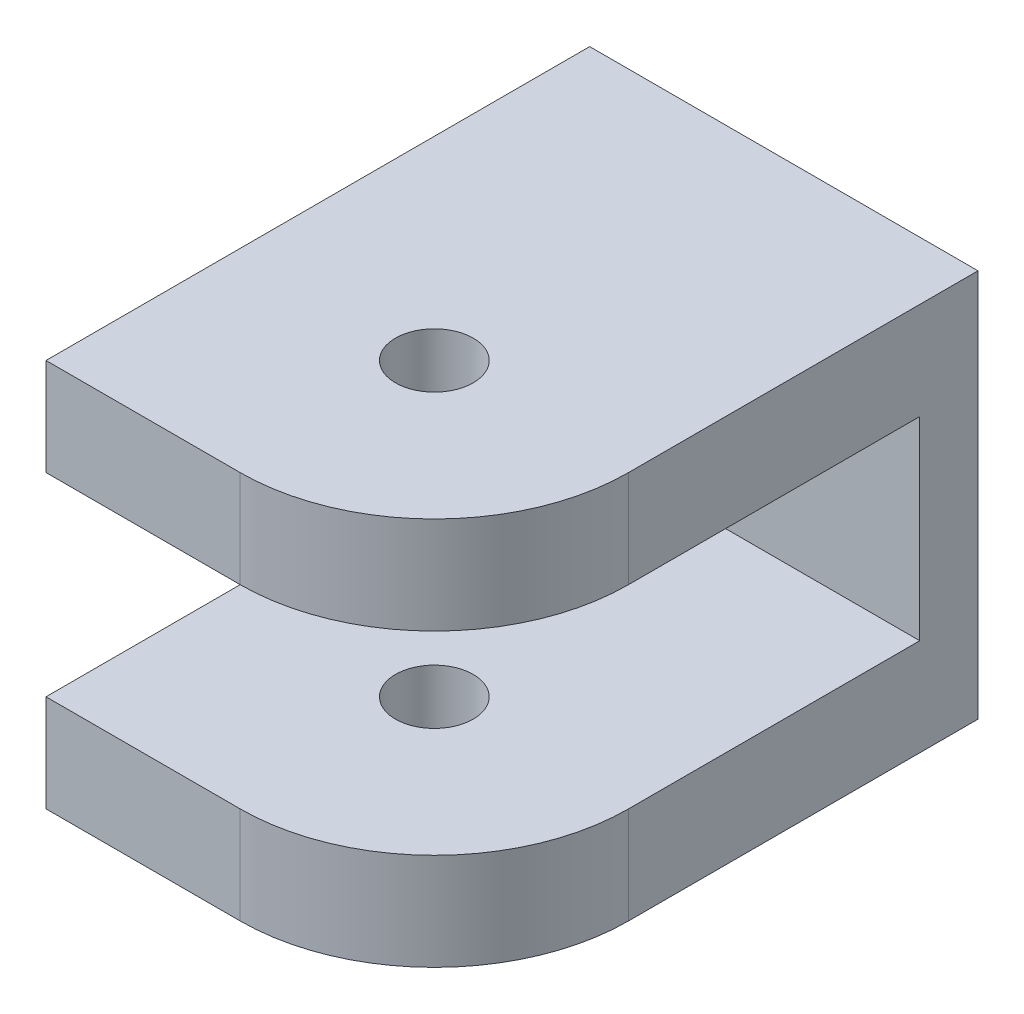
ISO-10303-21;
HEADER;
FILE_DESCRIPTION(('STEP AP214'),'2;1');
FILE_NAME('part.step','',(''),(''),'','','');
FILE_SCHEMA(('AUTOMOTIVE_DESIGN { 1 0 10303 214 1 1 1 1 }'));
ENDSEC;
DATA;
#1=APPLICATION_CONTEXT('core data for automotive mechanical design processes');
#2=APPLICATION_PROTOCOL_DEFINITION('international standard','automotive_design',2000,#1);
#3=PRODUCT_CONTEXT('',#1,'mechanical');
#4=PRODUCT('Part','Part','',(#3));
#5=PRODUCT_RELATED_PRODUCT_CATEGORY('part','',(#4));
#6=PRODUCT_DEFINITION_FORMATION('','',#4);
#7=PRODUCT_DEFINITION_CONTEXT('part definition',#1,'design');
#8=PRODUCT_DEFINITION('design','',#6,#7);
#9=PRODUCT_DEFINITION_SHAPE('','',#8);
#10=(LENGTH_UNIT() NAMED_UNIT(*) SI_UNIT(.MILLI.,.METRE.));
#11=(NAMED_UNIT(*) PLANE_ANGLE_UNIT() SI_UNIT($,.RADIAN.));
#12=(NAMED_UNIT(*) SI_UNIT($,.STERADIAN.) SOLID_ANGLE_UNIT());
#13=UNCERTAINTY_MEASURE_WITH_UNIT(LENGTH_MEASURE(1.E-05),#10,'distance_accuracy_value','');
#14=(GEOMETRIC_REPRESENTATION_CONTEXT(3) GLOBAL_UNCERTAINTY_ASSIGNED_CONTEXT((#13)) GLOBAL_UNIT_ASSIGNED_CONTEXT((#10,
#11,#12)) REPRESENTATION_CONTEXT('',''));
#15=CARTESIAN_POINT('',(0.,0.,0.));
#16=DIRECTION('',(0.,0.,1.));
#17=DIRECTION('',(1.,0.,0.));
#18=AXIS2_PLACEMENT_3D('',#15,#16,#17);
#19=CARTESIAN_POINT('',(0.,0.,0.));
#20=DIRECTION('',(0.,0.,-1.));
#21=DIRECTION('',(-1.,0.,0.));
#22=AXIS2_PLACEMENT_3D('',#19,#20,#21);
#23=PLANE('',#22);
#24=CARTESIAN_POINT('',(10.,10.,0.));
#25=DIRECTION('',(0.,0.,1.));
#26=DIRECTION('',(1.,0.,0.));
#27=AXIS2_PLACEMENT_3D('',#24,#25,#26);
#28=CIRCLE('',#27,1.55);
#29=CARTESIAN_POINT('',(11.55,10.,0.));
#30=VERTEX_POINT('',#29);
#31=EDGE_CURVE('E175',#30,#30,#28,.T.);
#32=ORIENTED_EDGE('',*,*,#31,.F.);
#33=EDGE_LOOP('',(#32));
#34=FACE_BOUND('',#33,.T.);
#35=DIRECTION('',(1.,0.,0.));
#36=VECTOR('',#35,1.);
#37=CARTESIAN_POINT('',(20.,15.,0.));
#38=LINE('',#37,#36);
#39=CARTESIAN_POINT('',(0.,15.,0.));
#40=VERTEX_POINT('',#39);
#41=CARTESIAN_POINT('',(20.,15.,0.));
#42=VERTEX_POINT('',#41);
#43=EDGE_CURVE('E49',#40,#42,#38,.T.);
#44=ORIENTED_EDGE('',*,*,#43,.F.);
#45=DIRECTION('',(0.,-1.,0.));
#46=VECTOR('',#45,1.);
#47=CARTESIAN_POINT('',(0.,0.,0.));
#48=LINE('',#47,#46);
#49=CARTESIAN_POINT('',(0.,5.,0.));
#50=VERTEX_POINT('',#49);
#51=EDGE_CURVE('E185',#40,#50,#48,.T.);
#52=ORIENTED_EDGE('',*,*,#51,.T.);
#53=DIRECTION('',(-1.,0.,0.));
#54=VECTOR('',#53,1.);
#55=CARTESIAN_POINT('',(20.,5.,0.));
#56=LINE('',#55,#54);
#57=CARTESIAN_POINT('',(20.,5.,0.));
#58=VERTEX_POINT('',#57);
#59=EDGE_CURVE('E169',#58,#50,#56,.T.);
#60=ORIENTED_EDGE('',*,*,#59,.F.);
#61=DIRECTION('',(0.,1.,0.));
#62=VECTOR('',#61,1.);
#63=CARTESIAN_POINT('',(20.,20.,0.));
#64=LINE('',#63,#62);
#65=EDGE_CURVE('E54',#58,#42,#64,.T.);
#66=ORIENTED_EDGE('',*,*,#65,.T.);
#67=EDGE_LOOP('',(#44,#52,#60,#66));
#68=FACE_BOUND('',#67,.T.);
#69=ADVANCED_FACE('F32',(#34,#68),#23,.F.);
#70=CARTESIAN_POINT('',(20.,0.,-3.));
#71=DIRECTION('',(0.,-1.,0.));
#72=DIRECTION('',(1.,0.,0.));
#73=AXIS2_PLACEMENT_3D('',#70,#71,#72);
#74=PLANE('',#73);
#75=CARTESIAN_POINT('',(10.,0.,15.));
#76=DIRECTION('',(0.,-1.,0.));
#77=DIRECTION('',(1.,0.,0.));
#78=AXIS2_PLACEMENT_3D('',#75,#76,#77);
#79=CIRCLE('',#78,2.);
#80=CARTESIAN_POINT('',(12.,0.,15.));
#81=VERTEX_POINT('',#80);
#82=EDGE_CURVE('E280',#81,#81,#79,.T.);
#83=ORIENTED_EDGE('',*,*,#82,.F.);
#84=EDGE_LOOP('',(#83));
#85=FACE_BOUND('',#84,.T.);
#86=DIRECTION('',(0.,0.,1.));
#87=VECTOR('',#86,1.);
#88=CARTESIAN_POINT('',(20.,0.,-3.));
#89=LINE('',#88,#87);
#90=CARTESIAN_POINT('',(20.,0.,-3.));
#91=VERTEX_POINT('',#90);
#92=CARTESIAN_POINT('',(20.,0.,15.));
#93=VERTEX_POINT('',#92);
#94=EDGE_CURVE('E194',#91,#93,#89,.T.);
#95=ORIENTED_EDGE('',*,*,#94,.T.);
#96=CARTESIAN_POINT('',(10.,0.,15.));
#97=DIRECTION('',(0.,-1.,0.));
#98=DIRECTION('',(1.,0.,0.));
#99=AXIS2_PLACEMENT_3D('',#96,#97,#98);
#100=CIRCLE('',#99,10.);
#101=CARTESIAN_POINT('',(10.,0.,25.));
#102=VERTEX_POINT('',#101);
#103=EDGE_CURVE('E137',#93,#102,#100,.T.);
#104=ORIENTED_EDGE('',*,*,#103,.T.);
#105=DIRECTION('',(-1.,0.,0.));
#106=VECTOR('',#105,1.);
#107=CARTESIAN_POINT('',(0.,0.,25.));
#108=LINE('',#107,#106);
#109=CARTESIAN_POINT('',(0.,0.,25.));
#110=VERTEX_POINT('',#109);
#111=EDGE_CURVE('E115',#102,#110,#108,.T.);
#112=ORIENTED_EDGE('',*,*,#111,.T.);
#113=DIRECTION('',(0.,0.,1.));
#114=VECTOR('',#113,1.);
#115=CARTESIAN_POINT('',(0.,0.,-3.));
#116=LINE('',#115,#114);
#117=CARTESIAN_POINT('',(0.,0.,-3.));
#118=VERTEX_POINT('',#117);
#119=EDGE_CURVE('E11',#118,#110,#116,.T.);
#120=ORIENTED_EDGE('',*,*,#119,.F.);
#121=DIRECTION('',(1.,0.,0.));
#122=VECTOR('',#121,1.);
#123=CARTESIAN_POINT('',(20.,0.,-3.));
#124=LINE('',#123,#122);
#125=EDGE_CURVE('E181',#118,#91,#124,.T.);
#126=ORIENTED_EDGE('',*,*,#125,.T.);
#127=EDGE_LOOP('',(#95,#104,#112,#120,#126));
#128=FACE_BOUND('',#127,.T.);
#129=ADVANCED_FACE('F34',(#85,#128),#74,.T.);
#130=CARTESIAN_POINT('',(0.,0.,-3.));
#131=DIRECTION('',(-1.,0.,0.));
#132=DIRECTION('',(0.,0.,1.));
#133=AXIS2_PLACEMENT_3D('',#130,#131,#132);
#134=PLANE('',#133);
#135=ORIENTED_EDGE('',*,*,#51,.F.);
#136=DIRECTION('',(0.,0.,-1.));
#137=VECTOR('',#136,1.);
#138=CARTESIAN_POINT('',(0.,15.,15.));
#139=LINE('',#138,#137);
#140=CARTESIAN_POINT('',(0.,15.,25.));
#141=VERTEX_POINT('',#140);
#142=EDGE_CURVE('E166',#141,#40,#139,.T.);
#143=ORIENTED_EDGE('',*,*,#142,.F.);
#144=DIRECTION('',(0.,1.,0.));
#145=VECTOR('',#144,1.);
#146=CARTESIAN_POINT('',(0.,15.,25.));
#147=LINE('',#146,#145);
#148=CARTESIAN_POINT('',(0.,20.,25.));
#149=VERTEX_POINT('',#148);
#150=EDGE_CURVE('E150',#141,#149,#147,.T.);
#151=ORIENTED_EDGE('',*,*,#150,.T.);
#152=DIRECTION('',(0.,0.,1.));
#153=VECTOR('',#152,1.);
#154=CARTESIAN_POINT('',(0.,20.,-3.));
#155=LINE('',#154,#153);
#156=CARTESIAN_POINT('',(0.,20.,-3.));
#157=VERTEX_POINT('',#156);
#158=EDGE_CURVE('E41',#157,#149,#155,.T.);
#159=ORIENTED_EDGE('',*,*,#158,.F.);
#160=DIRECTION('',(0.,-1.,0.));
#161=VECTOR('',#160,1.);
#162=CARTESIAN_POINT('',(0.,0.,-3.));
#163=LINE('',#162,#161);
#164=EDGE_CURVE('E191',#157,#118,#163,.T.);
#165=ORIENTED_EDGE('',*,*,#164,.T.);
#166=ORIENTED_EDGE('',*,*,#119,.T.);
#167=DIRECTION('',(0.,-1.,0.));
#168=VECTOR('',#167,1.);
#169=CARTESIAN_POINT('',(0.,5.,25.));
#170=LINE('',#169,#168);
#171=CARTESIAN_POINT('',(0.,5.,25.));
#172=VERTEX_POINT('',#171);
#173=EDGE_CURVE('E119',#172,#110,#170,.T.);
#174=ORIENTED_EDGE('',*,*,#173,.F.);
#175=DIRECTION('',(0.,0.,-1.));
#176=VECTOR('',#175,1.);
#177=CARTESIAN_POINT('',(0.,5.,15.));
#178=LINE('',#177,#176);
#179=EDGE_CURVE('E132',#172,#50,#178,.T.);
#180=ORIENTED_EDGE('',*,*,#179,.T.);
#181=EDGE_LOOP('',(#135,#143,#151,#159,#165,#166,#174,#180));
#182=FACE_BOUND('',#181,.T.);
#183=ADVANCED_FACE('F224',(#182),#134,.T.);
#184=CARTESIAN_POINT('',(0.,20.,-3.));
#185=DIRECTION('',(0.,1.,0.));
#186=DIRECTION('',(0.,0.,1.));
#187=AXIS2_PLACEMENT_3D('',#184,#185,#186);
#188=PLANE('',#187);
#189=CARTESIAN_POINT('',(10.,20.,15.));
#190=DIRECTION('',(0.,-1.,0.));
#191=DIRECTION('',(1.,0.,0.));
#192=AXIS2_PLACEMENT_3D('',#189,#190,#191);
#193=CIRCLE('',#192,2.);
#194=CARTESIAN_POINT('',(12.,20.,15.));
#195=VERTEX_POINT('',#194);
#196=EDGE_CURVE('E284',#195,#195,#193,.T.);
#197=ORIENTED_EDGE('',*,*,#196,.T.);
#198=EDGE_LOOP('',(#197));
#199=FACE_BOUND('',#198,.T.);
#200=ORIENTED_EDGE('',*,*,#158,.T.);
#201=DIRECTION('',(1.,0.,0.));
#202=VECTOR('',#201,1.);
#203=CARTESIAN_POINT('',(10.,20.,25.));
#204=LINE('',#203,#202);
#205=CARTESIAN_POINT('',(10.,20.,25.));
#206=VERTEX_POINT('',#205);
#207=EDGE_CURVE('E147',#149,#206,#204,.T.);
#208=ORIENTED_EDGE('',*,*,#207,.T.);
#209=CARTESIAN_POINT('',(10.,20.,15.));
#210=DIRECTION('',(0.,1.,0.));
#211=DIRECTION('',(0.,0.,1.));
#212=AXIS2_PLACEMENT_3D('',#209,#210,#211);
#213=CIRCLE('',#212,10.);
#214=CARTESIAN_POINT('',(20.,20.,15.));
#215=VERTEX_POINT('',#214);
#216=EDGE_CURVE('E141',#206,#215,#213,.T.);
#217=ORIENTED_EDGE('',*,*,#216,.T.);
#218=DIRECTION('',(0.,0.,1.));
#219=VECTOR('',#218,1.);
#220=CARTESIAN_POINT('',(20.,20.,-3.));
#221=LINE('',#220,#219);
#222=CARTESIAN_POINT('',(20.,20.,-3.));
#223=VERTEX_POINT('',#222);
#224=EDGE_CURVE('E198',#223,#215,#221,.T.);
#225=ORIENTED_EDGE('',*,*,#224,.F.);
#226=DIRECTION('',(-1.,0.,0.));
#227=VECTOR('',#226,1.);
#228=CARTESIAN_POINT('',(0.,20.,-3.));
#229=LINE('',#228,#227);
#230=EDGE_CURVE('E188',#223,#157,#229,.T.);
#231=ORIENTED_EDGE('',*,*,#230,.T.);
#232=EDGE_LOOP('',(#200,#208,#217,#225,#231));
#233=FACE_BOUND('',#232,.T.);
#234=ADVANCED_FACE('F210',(#199,#233),#188,.T.);
#235=CARTESIAN_POINT('',(20.,20.,-3.));
#236=DIRECTION('',(1.,0.,0.));
#237=DIRECTION('',(0.,1.,0.));
#238=AXIS2_PLACEMENT_3D('',#235,#236,#237);
#239=PLANE('',#238);
#240=ORIENTED_EDGE('',*,*,#65,.F.);
#241=DIRECTION('',(0.,0.,-1.));
#242=VECTOR('',#241,1.);
#243=CARTESIAN_POINT('',(20.,5.,15.));
#244=LINE('',#243,#242);
#245=CARTESIAN_POINT('',(20.,5.,15.));
#246=VERTEX_POINT('',#245);
#247=EDGE_CURVE('E173',#246,#58,#244,.T.);
#248=ORIENTED_EDGE('',*,*,#247,.F.);
#249=DIRECTION('',(0.,1.,0.));
#250=VECTOR('',#249,1.);
#251=CARTESIAN_POINT('',(20.,0.,15.));
#252=LINE('',#251,#250);
#253=EDGE_CURVE('E125',#93,#246,#252,.T.);
#254=ORIENTED_EDGE('',*,*,#253,.F.);
#255=ORIENTED_EDGE('',*,*,#94,.F.);
#256=DIRECTION('',(0.,1.,0.));
#257=VECTOR('',#256,1.);
#258=CARTESIAN_POINT('',(20.,20.,-3.));
#259=LINE('',#258,#257);
#260=EDGE_CURVE('E184',#91,#223,#259,.T.);
#261=ORIENTED_EDGE('',*,*,#260,.T.);
#262=ORIENTED_EDGE('',*,*,#224,.T.);
#263=DIRECTION('',(0.,1.,0.));
#264=VECTOR('',#263,1.);
#265=CARTESIAN_POINT('',(20.,20.,15.));
#266=LINE('',#265,#264);
#267=CARTESIAN_POINT('',(20.,15.,15.));
#268=VERTEX_POINT('',#267);
#269=EDGE_CURVE('E159',#268,#215,#266,.T.);
#270=ORIENTED_EDGE('',*,*,#269,.F.);
#271=DIRECTION('',(0.,0.,-1.));
#272=VECTOR('',#271,1.);
#273=CARTESIAN_POINT('',(20.,15.,15.));
#274=LINE('',#273,#272);
#275=EDGE_CURVE('E162',#268,#42,#274,.T.);
#276=ORIENTED_EDGE('',*,*,#275,.T.);
#277=EDGE_LOOP('',(#240,#248,#254,#255,#261,#262,#270,#276));
#278=FACE_BOUND('',#277,.T.);
#279=ADVANCED_FACE('F204',(#278),#239,.T.);
#280=CARTESIAN_POINT('',(0.,0.,-3.));
#281=DIRECTION('',(0.,0.,-1.));
#282=DIRECTION('',(-1.,0.,0.));
#283=AXIS2_PLACEMENT_3D('',#280,#281,#282);
#284=PLANE('',#283);
#285=CARTESIAN_POINT('',(10.,10.,-3.));
#286=DIRECTION('',(0.,0.,1.));
#287=DIRECTION('',(1.,0.,0.));
#288=AXIS2_PLACEMENT_3D('',#285,#286,#287);
#289=CIRCLE('',#288,1.55);
#290=CARTESIAN_POINT('',(11.55,10.,-3.));
#291=VERTEX_POINT('',#290);
#292=EDGE_CURVE('E176',#291,#291,#289,.T.);
#293=ORIENTED_EDGE('',*,*,#292,.T.);
#294=EDGE_LOOP('',(#293));
#295=FACE_BOUND('',#294,.T.);
#296=ORIENTED_EDGE('',*,*,#125,.F.);
#297=ORIENTED_EDGE('',*,*,#164,.F.);
#298=ORIENTED_EDGE('',*,*,#230,.F.);
#299=ORIENTED_EDGE('',*,*,#260,.F.);
#300=EDGE_LOOP('',(#296,#297,#298,#299));
#301=FACE_BOUND('',#300,.T.);
#302=ADVANCED_FACE('F207',(#295,#301),#284,.T.);
#303=CARTESIAN_POINT('',(10.,10.,-3.));
#304=DIRECTION('',(0.,0.,1.));
#305=DIRECTION('',(1.,0.,0.));
#306=AXIS2_PLACEMENT_3D('',#303,#304,#305);
#307=CYLINDRICAL_SURFACE('',#306,1.55);
#308=ORIENTED_EDGE('',*,*,#292,.F.);
#309=EDGE_LOOP('',(#308));
#310=FACE_BOUND('',#309,.T.);
#311=ORIENTED_EDGE('',*,*,#31,.T.);
#312=EDGE_LOOP('',(#311));
#313=FACE_BOUND('',#312,.T.);
#314=ADVANCED_FACE('F244',(#310,#313),#307,.F.);
#315=CARTESIAN_POINT('',(20.,5.,15.));
#316=DIRECTION('',(0.,-1.,0.));
#317=DIRECTION('',(1.,0.,0.));
#318=AXIS2_PLACEMENT_3D('',#315,#316,#317);
#319=PLANE('',#318);
#320=CARTESIAN_POINT('',(10.,5.,15.));
#321=DIRECTION('',(0.,-1.,0.));
#322=DIRECTION('',(1.,0.,0.));
#323=AXIS2_PLACEMENT_3D('',#320,#321,#322);
#324=CIRCLE('',#323,2.);
#325=CARTESIAN_POINT('',(12.,5.,15.));
#326=VERTEX_POINT('',#325);
#327=EDGE_CURVE('E139',#326,#326,#324,.T.);
#328=ORIENTED_EDGE('',*,*,#327,.T.);
#329=EDGE_LOOP('',(#328));
#330=FACE_BOUND('',#329,.T.);
#331=ORIENTED_EDGE('',*,*,#59,.T.);
#332=ORIENTED_EDGE('',*,*,#179,.F.);
#333=DIRECTION('',(-1.,0.,0.));
#334=VECTOR('',#333,1.);
#335=CARTESIAN_POINT('',(0.,5.,25.));
#336=LINE('',#335,#334);
#337=CARTESIAN_POINT('',(10.,5.,25.));
#338=VERTEX_POINT('',#337);
#339=EDGE_CURVE('E113',#338,#172,#336,.T.);
#340=ORIENTED_EDGE('',*,*,#339,.F.);
#341=CARTESIAN_POINT('',(10.,5.,15.));
#342=DIRECTION('',(0.,-1.,0.));
#343=DIRECTION('',(1.,0.,0.));
#344=AXIS2_PLACEMENT_3D('',#341,#342,#343);
#345=CIRCLE('',#344,10.);
#346=EDGE_CURVE('E123',#246,#338,#345,.T.);
#347=ORIENTED_EDGE('',*,*,#346,.F.);
#348=ORIENTED_EDGE('',*,*,#247,.T.);
#349=EDGE_LOOP('',(#331,#332,#340,#347,#348));
#350=FACE_BOUND('',#349,.T.);
#351=ADVANCED_FACE('F130',(#330,#350),#319,.F.);
#352=CARTESIAN_POINT('',(20.,15.,15.));
#353=DIRECTION('',(0.,1.,0.));
#354=DIRECTION('',(-1.,0.,0.));
#355=AXIS2_PLACEMENT_3D('',#352,#353,#354);
#356=PLANE('',#355);
#357=CARTESIAN_POINT('',(10.,15.,15.));
#358=DIRECTION('',(0.,1.,0.));
#359=DIRECTION('',(-1.,0.,0.));
#360=AXIS2_PLACEMENT_3D('',#357,#358,#359);
#361=CIRCLE('',#360,2.);
#362=CARTESIAN_POINT('',(8.,15.,15.));
#363=VERTEX_POINT('',#362);
#364=EDGE_CURVE('E36',#363,#363,#361,.T.);
#365=ORIENTED_EDGE('',*,*,#364,.T.);
#366=EDGE_LOOP('',(#365));
#367=FACE_BOUND('',#366,.T.);
#368=ORIENTED_EDGE('',*,*,#43,.T.);
#369=ORIENTED_EDGE('',*,*,#275,.F.);
#370=CARTESIAN_POINT('',(10.,15.,15.));
#371=DIRECTION('',(0.,1.,0.));
#372=DIRECTION('',(0.,0.,1.));
#373=AXIS2_PLACEMENT_3D('',#370,#371,#372);
#374=CIRCLE('',#373,10.);
#375=CARTESIAN_POINT('',(10.,15.,25.));
#376=VERTEX_POINT('',#375);
#377=EDGE_CURVE('E143',#376,#268,#374,.T.);
#378=ORIENTED_EDGE('',*,*,#377,.F.);
#379=DIRECTION('',(1.,0.,0.));
#380=VECTOR('',#379,1.);
#381=CARTESIAN_POINT('',(10.,15.,25.));
#382=LINE('',#381,#380);
#383=EDGE_CURVE('E146',#141,#376,#382,.T.);
#384=ORIENTED_EDGE('',*,*,#383,.F.);
#385=ORIENTED_EDGE('',*,*,#142,.T.);
#386=EDGE_LOOP('',(#368,#369,#378,#384,#385));
#387=FACE_BOUND('',#386,.T.);
#388=ADVANCED_FACE('F218',(#367,#387),#356,.F.);
#389=CARTESIAN_POINT('',(10.,15.,15.));
#390=DIRECTION('',(0.,1.,0.));
#391=DIRECTION('',(0.,0.,1.));
#392=AXIS2_PLACEMENT_3D('',#389,#390,#391);
#393=CYLINDRICAL_SURFACE('',#392,10.);
#394=ORIENTED_EDGE('',*,*,#216,.F.);
#395=DIRECTION('',(0.,1.,0.));
#396=VECTOR('',#395,1.);
#397=CARTESIAN_POINT('',(10.,15.,25.));
#398=LINE('',#397,#396);
#399=EDGE_CURVE('E155',#376,#206,#398,.T.);
#400=ORIENTED_EDGE('',*,*,#399,.F.);
#401=ORIENTED_EDGE('',*,*,#377,.T.);
#402=ORIENTED_EDGE('',*,*,#269,.T.);
#403=EDGE_LOOP('',(#394,#400,#401,#402));
#404=FACE_BOUND('',#403,.T.);
#405=ADVANCED_FACE('F214',(#404),#393,.T.);
#406=CARTESIAN_POINT('',(10.,15.,25.));
#407=DIRECTION('',(0.,0.,1.));
#408=DIRECTION('',(1.,0.,0.));
#409=AXIS2_PLACEMENT_3D('',#406,#407,#408);
#410=PLANE('',#409);
#411=ORIENTED_EDGE('',*,*,#207,.F.);
#412=ORIENTED_EDGE('',*,*,#150,.F.);
#413=ORIENTED_EDGE('',*,*,#383,.T.);
#414=ORIENTED_EDGE('',*,*,#399,.T.);
#415=EDGE_LOOP('',(#411,#412,#413,#414));
#416=FACE_BOUND('',#415,.T.);
#417=ADVANCED_FACE('F222',(#416),#410,.T.);
#418=CARTESIAN_POINT('',(0.,5.,25.));
#419=DIRECTION('',(0.,0.,1.));
#420=DIRECTION('',(1.,0.,0.));
#421=AXIS2_PLACEMENT_3D('',#418,#419,#420);
#422=PLANE('',#421);
#423=ORIENTED_EDGE('',*,*,#111,.F.);
#424=DIRECTION('',(0.,-1.,0.));
#425=VECTOR('',#424,1.);
#426=CARTESIAN_POINT('',(10.,5.,25.));
#427=LINE('',#426,#425);
#428=EDGE_CURVE('E108',#338,#102,#427,.T.);
#429=ORIENTED_EDGE('',*,*,#428,.F.);
#430=ORIENTED_EDGE('',*,*,#339,.T.);
#431=ORIENTED_EDGE('',*,*,#173,.T.);
#432=EDGE_LOOP('',(#423,#429,#430,#431));
#433=FACE_BOUND('',#432,.T.);
#434=ADVANCED_FACE('F110',(#433),#422,.T.);
#435=CARTESIAN_POINT('',(10.,5.,15.));
#436=DIRECTION('',(0.,-1.,0.));
#437=DIRECTION('',(1.,0.,0.));
#438=AXIS2_PLACEMENT_3D('',#435,#436,#437);
#439=CYLINDRICAL_SURFACE('',#438,10.);
#440=ORIENTED_EDGE('',*,*,#103,.F.);
#441=ORIENTED_EDGE('',*,*,#253,.T.);
#442=ORIENTED_EDGE('',*,*,#346,.T.);
#443=ORIENTED_EDGE('',*,*,#428,.T.);
#444=EDGE_LOOP('',(#440,#441,#442,#443));
#445=FACE_BOUND('',#444,.T.);
#446=ADVANCED_FACE('F124',(#445),#439,.T.);
#447=CARTESIAN_POINT('',(10.,20.,15.));
#448=DIRECTION('',(0.,-1.,0.));
#449=DIRECTION('',(1.,0.,0.));
#450=AXIS2_PLACEMENT_3D('',#447,#448,#449);
#451=CYLINDRICAL_SURFACE('',#450,2.);
#452=ORIENTED_EDGE('',*,*,#196,.F.);
#453=EDGE_LOOP('',(#452));
#454=FACE_BOUND('',#453,.T.);
#455=ORIENTED_EDGE('',*,*,#364,.F.);
#456=EDGE_LOOP('',(#455));
#457=FACE_BOUND('',#456,.T.);
#458=ADVANCED_FACE('F267',(#454,#457),#451,.F.);
#459=ORIENTED_EDGE('',*,*,#82,.T.);
#460=EDGE_LOOP('',(#459));
#461=FACE_BOUND('',#460,.T.);
#462=ORIENTED_EDGE('',*,*,#327,.F.);
#463=EDGE_LOOP('',(#462));
#464=FACE_BOUND('',#463,.T.);
#465=ADVANCED_FACE('F270',(#461,#464),#451,.F.);
#466=CLOSED_SHELL('',(#69,#129,#183,#234,#279,#302,#314,#351,#388,#405,#417,#434,#446,#458,#465));
#467=MANIFOLD_SOLID_BREP('B2',#466);
#468=ADVANCED_BREP_SHAPE_REPRESENTATION('',(#18,#467),#14);
#469=SHAPE_DEFINITION_REPRESENTATION(#9,#468);
ENDSEC;
END-ISO-10303-21;
